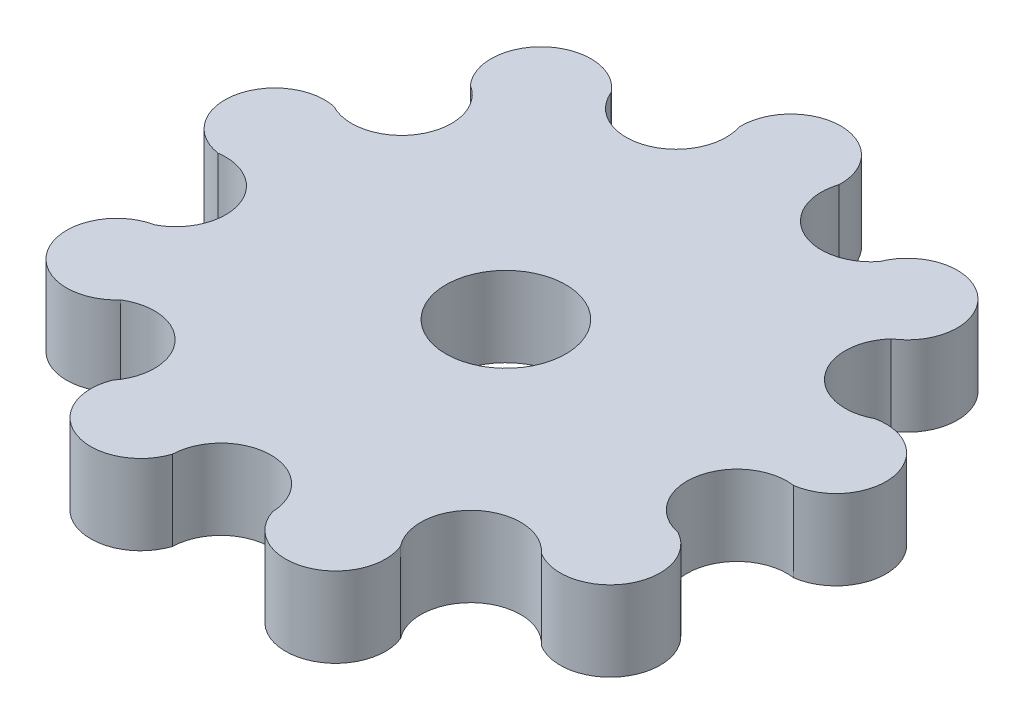
ISO-10303-21;
HEADER;
FILE_DESCRIPTION(('STEP AP214'),'2;1');
FILE_NAME('part.step','',(''),(''),'','','');
FILE_SCHEMA(('AUTOMOTIVE_DESIGN { 1 0 10303 214 1 1 1 1 }'));
ENDSEC;
DATA;
#1=APPLICATION_CONTEXT('core data for automotive mechanical design processes');
#2=APPLICATION_PROTOCOL_DEFINITION('international standard','automotive_design',2000,#1);
#3=PRODUCT_CONTEXT('',#1,'mechanical');
#4=PRODUCT('Part','Part','',(#3));
#5=PRODUCT_RELATED_PRODUCT_CATEGORY('part','',(#4));
#6=PRODUCT_DEFINITION_FORMATION('','',#4);
#7=PRODUCT_DEFINITION_CONTEXT('part definition',#1,'design');
#8=PRODUCT_DEFINITION('design','',#6,#7);
#9=PRODUCT_DEFINITION_SHAPE('','',#8);
#10=(LENGTH_UNIT() NAMED_UNIT(*) SI_UNIT(.MILLI.,.METRE.));
#11=(NAMED_UNIT(*) PLANE_ANGLE_UNIT() SI_UNIT($,.RADIAN.));
#12=(NAMED_UNIT(*) SI_UNIT($,.STERADIAN.) SOLID_ANGLE_UNIT());
#13=UNCERTAINTY_MEASURE_WITH_UNIT(LENGTH_MEASURE(1.E-05),#10,'distance_accuracy_value','');
#14=(GEOMETRIC_REPRESENTATION_CONTEXT(3) GLOBAL_UNCERTAINTY_ASSIGNED_CONTEXT((#13)) GLOBAL_UNIT_ASSIGNED_CONTEXT((#10,
#11,#12)) REPRESENTATION_CONTEXT('',''));
#15=CARTESIAN_POINT('',(0.,0.,0.));
#16=DIRECTION('',(0.,0.,1.));
#17=DIRECTION('',(1.,0.,0.));
#18=AXIS2_PLACEMENT_3D('',#15,#16,#17);
#19=CARTESIAN_POINT('',(18.319446876068,8.,-21.8322666288953));
#20=DIRECTION('',(0.,-1.,0.));
#21=DIRECTION('',(0.,0.,-1.));
#22=AXIS2_PLACEMENT_3D('',#19,#20,#21);
#23=CYLINDRICAL_SURFACE('',#22,5.);
#24=CARTESIAN_POINT('',(18.319446876068,0.,-21.8322666288953));
#25=DIRECTION('',(0.,1.,0.));
#26=DIRECTION('',(0.,0.,1.));
#27=AXIS2_PLACEMENT_3D('',#24,#25,#26);
#28=CIRCLE('',#27,5.);
#29=CARTESIAN_POINT('',(20.9547737409731,0.,-17.5831429174567));
#30=VERTEX_POINT('',#29);
#31=CARTESIAN_POINT('',(13.6772571938869,0.,-23.6897043680004));
#32=VERTEX_POINT('',#31);
#33=EDGE_CURVE('E392',#30,#32,#28,.T.);
#34=ORIENTED_EDGE('',*,*,#33,.T.);
#35=DIRECTION('',(0.,-1.,0.));
#36=VECTOR('',#35,1.);
#37=CARTESIAN_POINT('',(13.6772571938869,4.,-23.6897043680004));
#38=LINE('',#37,#36);
#39=CARTESIAN_POINT('',(13.6772571938869,8.,-23.6897043680004));
#40=VERTEX_POINT('',#39);
#41=EDGE_CURVE('E293',#40,#32,#38,.T.);
#42=ORIENTED_EDGE('',*,*,#41,.F.);
#43=CARTESIAN_POINT('',(18.319446876068,8.,-21.8322666288953));
#44=DIRECTION('',(0.,1.,0.));
#45=DIRECTION('',(0.,0.,1.));
#46=AXIS2_PLACEMENT_3D('',#43,#44,#45);
#47=CIRCLE('',#46,5.);
#48=CARTESIAN_POINT('',(20.9547737409731,8.,-17.5831429174567));
#49=VERTEX_POINT('',#48);
#50=EDGE_CURVE('E174',#49,#40,#47,.T.);
#51=ORIENTED_EDGE('',*,*,#50,.F.);
#52=DIRECTION('',(0.,-1.,0.));
#53=VECTOR('',#52,1.);
#54=CARTESIAN_POINT('',(20.9547737409731,4.,-17.5831429174567));
#55=LINE('',#54,#53);
#56=EDGE_CURVE('E161',#30,#49,#55,.F.);
#57=ORIENTED_EDGE('',*,*,#56,.F.);
#58=EDGE_LOOP('',(#34,#42,#51,#57));
#59=FACE_BOUND('',#58,.T.);
#60=ADVANCED_FACE('F157',(#59),#23,.T.);
#61=CARTESIAN_POINT('',(-24.6817240078463,8.,14.2500000000059));
#62=DIRECTION('',(0.,-1.,0.));
#63=DIRECTION('',(0.,0.,-1.));
#64=AXIS2_PLACEMENT_3D('',#61,#62,#63);
#65=CYLINDRICAL_SURFACE('',#64,5.);
#66=CARTESIAN_POINT('',(-24.6817240078463,0.,14.2500000000059));
#67=DIRECTION('',(0.,1.,0.));
#68=DIRECTION('',(0.,0.,1.));
#69=AXIS2_PLACEMENT_3D('',#66,#67,#68);
#70=CIRCLE('',#69,5.);
#71=CARTESIAN_POINT('',(-25.7048353153619,0.,9.35579493151586));
#72=VERTEX_POINT('',#71);
#73=CARTESIAN_POINT('',(-20.9547737409595,0.,17.5831429174567));
#74=VERTEX_POINT('',#73);
#75=EDGE_CURVE('E364',#72,#74,#70,.T.);
#76=ORIENTED_EDGE('',*,*,#75,.T.);
#77=DIRECTION('',(0.,-1.,0.));
#78=VECTOR('',#77,1.);
#79=CARTESIAN_POINT('',(-20.9547737409595,4.,17.5831429174567));
#80=LINE('',#79,#78);
#81=CARTESIAN_POINT('',(-20.9547737409595,8.,17.5831429174567));
#82=VERTEX_POINT('',#81);
#83=EDGE_CURVE('E166',#82,#74,#80,.T.);
#84=ORIENTED_EDGE('',*,*,#83,.F.);
#85=CARTESIAN_POINT('',(-24.6817240078463,8.,14.2500000000059));
#86=DIRECTION('',(0.,1.,0.));
#87=DIRECTION('',(0.,0.,1.));
#88=AXIS2_PLACEMENT_3D('',#85,#86,#87);
#89=CIRCLE('',#88,5.);
#90=CARTESIAN_POINT('',(-25.7048353153619,8.,9.35579493151586));
#91=VERTEX_POINT('',#90);
#92=EDGE_CURVE('E322',#91,#82,#89,.T.);
#93=ORIENTED_EDGE('',*,*,#92,.F.);
#94=DIRECTION('',(0.,-1.,0.));
#95=VECTOR('',#94,1.);
#96=CARTESIAN_POINT('',(-25.7048353153619,4.,9.35579493151586));
#97=LINE('',#96,#95);
#98=EDGE_CURVE('E12',#72,#91,#97,.F.);
#99=ORIENTED_EDGE('',*,*,#98,.F.);
#100=EDGE_LOOP('',(#76,#84,#93,#99));
#101=FACE_BOUND('',#100,.T.);
#102=ADVANCED_FACE('F469',(#101),#65,.T.);
#103=CARTESIAN_POINT('',(0.,8.,-28.5));
#104=DIRECTION('',(0.,-1.,0.));
#105=DIRECTION('',(0.,0.,-1.));
#106=AXIS2_PLACEMENT_3D('',#103,#104,#105);
#107=CYLINDRICAL_SURFACE('',#106,5.);
#108=CARTESIAN_POINT('',(0.,0.,-28.5));
#109=DIRECTION('',(0.,1.,0.));
#110=DIRECTION('',(0.,0.,1.));
#111=AXIS2_PLACEMENT_3D('',#108,#109,#110);
#112=CIRCLE('',#111,5.);
#113=CARTESIAN_POINT('',(4.99751251038124,0.,-28.3423018434382));
#114=VERTEX_POINT('',#113);
#115=CARTESIAN_POINT('',(-4.99751251038116,0.,-28.3423018434357));
#116=VERTEX_POINT('',#115);
#117=EDGE_CURVE('E307',#114,#116,#112,.T.);
#118=ORIENTED_EDGE('',*,*,#117,.T.);
#119=DIRECTION('',(0.,-1.,0.));
#120=VECTOR('',#119,1.);
#121=CARTESIAN_POINT('',(-4.99751251038116,8.,-28.3423018434357));
#122=LINE('',#121,#120);
#123=CARTESIAN_POINT('',(-4.99751251038116,8.,-28.3423018434357));
#124=VERTEX_POINT('',#123);
#125=EDGE_CURVE('E352',#124,#116,#122,.T.);
#126=ORIENTED_EDGE('',*,*,#125,.F.);
#127=CARTESIAN_POINT('',(0.,8.,-28.5));
#128=DIRECTION('',(0.,1.,0.));
#129=DIRECTION('',(0.,0.,1.));
#130=AXIS2_PLACEMENT_3D('',#127,#128,#129);
#131=CIRCLE('',#130,5.);
#132=CARTESIAN_POINT('',(4.99751251038124,8.,-28.3423018434382));
#133=VERTEX_POINT('',#132);
#134=EDGE_CURVE('E305',#133,#124,#131,.T.);
#135=ORIENTED_EDGE('',*,*,#134,.F.);
#136=DIRECTION('',(0.,-1.,0.));
#137=VECTOR('',#136,1.);
#138=CARTESIAN_POINT('',(4.99751251038124,8.,-28.3423018434382));
#139=LINE('',#138,#137);
#140=EDGE_CURVE('E397',#133,#114,#139,.T.);
#141=ORIENTED_EDGE('',*,*,#140,.T.);
#142=EDGE_LOOP('',(#118,#126,#135,#141));
#143=FACE_BOUND('',#142,.T.);
#144=ADVANCED_FACE('F486',(#143),#107,.T.);
#145=CARTESIAN_POINT('',(-9.74757408478117,8.,-26.7812396923961));
#146=DIRECTION('',(0.,-1.,0.));
#147=DIRECTION('',(0.,0.,-1.));
#148=AXIS2_PLACEMENT_3D('',#145,#146,#147);
#149=CYLINDRICAL_SURFACE('',#148,5.);
#150=CARTESIAN_POINT('',(-9.74757408478117,0.,-26.7812396923961));
#151=DIRECTION('',(0.,1.,0.));
#152=DIRECTION('',(0.,0.,1.));
#153=AXIS2_PLACEMENT_3D('',#150,#151,#152);
#154=CIRCLE('',#153,5.);
#155=CARTESIAN_POINT('',(-14.3897637669613,0.,-24.9238019532888));
#156=VERTEX_POINT('',#155);
#157=EDGE_CURVE('E289',#156,#116,#154,.T.);
#158=ORIENTED_EDGE('',*,*,#157,.F.);
#159=DIRECTION('',(0.,-1.,0.));
#160=VECTOR('',#159,1.);
#161=CARTESIAN_POINT('',(-14.3897637669613,8.,-24.9238019532888));
#162=LINE('',#161,#160);
#163=CARTESIAN_POINT('',(-14.3897637669613,8.,-24.9238019532888));
#164=VERTEX_POINT('',#163);
#165=EDGE_CURVE('E284',#164,#156,#162,.T.);
#166=ORIENTED_EDGE('',*,*,#165,.F.);
#167=CARTESIAN_POINT('',(-9.74757408478117,8.,-26.7812396923961));
#168=DIRECTION('',(0.,1.,0.));
#169=DIRECTION('',(0.,0.,1.));
#170=AXIS2_PLACEMENT_3D('',#167,#168,#169);
#171=CIRCLE('',#170,5.);
#172=EDGE_CURVE('E287',#164,#124,#171,.T.);
#173=ORIENTED_EDGE('',*,*,#172,.T.);
#174=ORIENTED_EDGE('',*,*,#125,.T.);
#175=EDGE_LOOP('',(#158,#166,#173,#174));
#176=FACE_BOUND('',#175,.T.);
#177=ADVANCED_FACE('F159',(#176),#149,.F.);
#178=CARTESIAN_POINT('',(-18.3194468760648,8.,-21.8322666288865));
#179=DIRECTION('',(0.,-1.,0.));
#180=DIRECTION('',(0.,0.,-1.));
#181=AXIS2_PLACEMENT_3D('',#178,#179,#180);
#182=CYLINDRICAL_SURFACE('',#181,5.);
#183=CARTESIAN_POINT('',(-18.3194468760648,0.,-21.8322666288865));
#184=DIRECTION('',(0.,1.,0.));
#185=DIRECTION('',(0.,0.,1.));
#186=AXIS2_PLACEMENT_3D('',#183,#184,#185);
#187=CIRCLE('',#186,5.);
#188=CARTESIAN_POINT('',(-22.04639714295,0.,-18.4991237114339));
#189=VERTEX_POINT('',#188);
#190=EDGE_CURVE('E354',#156,#189,#187,.T.);
#191=ORIENTED_EDGE('',*,*,#190,.T.);
#192=DIRECTION('',(0.,-1.,0.));
#193=VECTOR('',#192,1.);
#194=CARTESIAN_POINT('',(-22.04639714295,8.,-18.4991237114339));
#195=LINE('',#194,#193);
#196=CARTESIAN_POINT('',(-22.04639714295,8.,-18.4991237114339));
#197=VERTEX_POINT('',#196);
#198=EDGE_CURVE('E294',#197,#189,#195,.T.);
#199=ORIENTED_EDGE('',*,*,#198,.F.);
#200=CARTESIAN_POINT('',(-18.3194468760648,8.,-21.8322666288865));
#201=DIRECTION('',(0.,1.,0.));
#202=DIRECTION('',(0.,0.,1.));
#203=AXIS2_PLACEMENT_3D('',#200,#201,#202);
#204=CIRCLE('',#203,5.);
#205=EDGE_CURVE('E297',#164,#197,#204,.T.);
#206=ORIENTED_EDGE('',*,*,#205,.F.);
#207=ORIENTED_EDGE('',*,*,#165,.T.);
#208=EDGE_LOOP('',(#191,#199,#206,#207));
#209=FACE_BOUND('',#208,.T.);
#210=ADVANCED_FACE('F298',(#209),#182,.T.);
#211=CARTESIAN_POINT('',(-24.6817240078531,8.,-14.2499999999941));
#212=DIRECTION('',(0.,-1.,0.));
#213=DIRECTION('',(0.,0.,-1.));
#214=AXIS2_PLACEMENT_3D('',#211,#212,#213);
#215=CYLINDRICAL_SURFACE('',#214,5.);
#216=CARTESIAN_POINT('',(-24.6817240078531,0.,-14.2499999999941));
#217=DIRECTION('',(0.,1.,0.));
#218=DIRECTION('',(0.,0.,1.));
#219=AXIS2_PLACEMENT_3D('',#216,#217,#218);
#220=CIRCLE('',#219,5.);
#221=CARTESIAN_POINT('',(-27.043909653329,0.,-9.84317813199133));
#222=VERTEX_POINT('',#221);
#223=EDGE_CURVE('E356',#222,#189,#220,.T.);
#224=ORIENTED_EDGE('',*,*,#223,.F.);
#225=DIRECTION('',(0.,-1.,0.));
#226=VECTOR('',#225,1.);
#227=CARTESIAN_POINT('',(-27.043909653329,8.,-9.84317813199133));
#228=LINE('',#227,#226);
#229=CARTESIAN_POINT('',(-27.043909653329,8.,-9.84317813199133));
#230=VERTEX_POINT('',#229);
#231=EDGE_CURVE('E419',#230,#222,#228,.T.);
#232=ORIENTED_EDGE('',*,*,#231,.F.);
#233=CARTESIAN_POINT('',(-24.6817240078531,8.,-14.2499999999941));
#234=DIRECTION('',(0.,1.,0.));
#235=DIRECTION('',(0.,0.,1.));
#236=AXIS2_PLACEMENT_3D('',#233,#234,#235);
#237=CIRCLE('',#236,5.);
#238=EDGE_CURVE('E301',#230,#197,#237,.T.);
#239=ORIENTED_EDGE('',*,*,#238,.T.);
#240=ORIENTED_EDGE('',*,*,#198,.T.);
#241=EDGE_LOOP('',(#224,#232,#239,#240));
#242=FACE_BOUND('',#241,.T.);
#243=ADVANCED_FACE('F482',(#242),#215,.F.);
#244=CARTESIAN_POINT('',(-28.0670209608423,8.,-4.94897306350079));
#245=DIRECTION('',(0.,-1.,0.));
#246=DIRECTION('',(0.,0.,-1.));
#247=AXIS2_PLACEMENT_3D('',#244,#245,#246);
#248=CYLINDRICAL_SURFACE('',#247,5.);
#249=CARTESIAN_POINT('',(-28.0670209608423,0.,-4.94897306350079));
#250=DIRECTION('',(0.,1.,0.));
#251=DIRECTION('',(0.,0.,1.));
#252=AXIS2_PLACEMENT_3D('',#249,#250,#251);
#253=CIRCLE('',#252,5.);
#254=CARTESIAN_POINT('',(-28.7795275339175,0.,6.88685219962792E-12));
#255=VERTEX_POINT('',#254);
#256=EDGE_CURVE('E359',#222,#255,#253,.T.);
#257=ORIENTED_EDGE('',*,*,#256,.T.);
#258=DIRECTION('',(0.,-1.,0.));
#259=VECTOR('',#258,1.);
#260=CARTESIAN_POINT('',(-28.7795275339175,8.,6.88685219962792E-12));
#261=LINE('',#260,#259);
#262=CARTESIAN_POINT('',(-28.7795275339175,8.,6.88685219962792E-12));
#263=VERTEX_POINT('',#262);
#264=EDGE_CURVE('E416',#263,#255,#261,.T.);
#265=ORIENTED_EDGE('',*,*,#264,.F.);
#266=CARTESIAN_POINT('',(-28.0670209608423,8.,-4.94897306350079));
#267=DIRECTION('',(0.,1.,0.));
#268=DIRECTION('',(0.,0.,1.));
#269=AXIS2_PLACEMENT_3D('',#266,#267,#268);
#270=CIRCLE('',#269,5.);
#271=EDGE_CURVE('E317',#230,#263,#270,.T.);
#272=ORIENTED_EDGE('',*,*,#271,.F.);
#273=ORIENTED_EDGE('',*,*,#231,.T.);
#274=EDGE_LOOP('',(#257,#265,#272,#273));
#275=FACE_BOUND('',#274,.T.);
#276=ADVANCED_FACE('F480',(#275),#248,.T.);
#277=CARTESIAN_POINT('',(-28.0670209608399,8.,4.94897306351423));
#278=DIRECTION('',(0.,-1.,0.));
#279=DIRECTION('',(0.,0.,-1.));
#280=AXIS2_PLACEMENT_3D('',#277,#278,#279);
#281=CYLINDRICAL_SURFACE('',#280,5.);
#282=CARTESIAN_POINT('',(-28.0670209608399,0.,4.94897306351423));
#283=DIRECTION('',(0.,1.,0.));
#284=DIRECTION('',(0.,0.,1.));
#285=AXIS2_PLACEMENT_3D('',#282,#283,#284);
#286=CIRCLE('',#285,5.);
#287=EDGE_CURVE('E362',#72,#255,#286,.T.);
#288=ORIENTED_EDGE('',*,*,#287,.F.);
#289=ORIENTED_EDGE('',*,*,#98,.T.);
#290=CARTESIAN_POINT('',(-28.0670209608399,8.,4.94897306351423));
#291=DIRECTION('',(0.,1.,0.));
#292=DIRECTION('',(0.,0.,1.));
#293=AXIS2_PLACEMENT_3D('',#290,#291,#292);
#294=CIRCLE('',#293,5.);
#295=EDGE_CURVE('E320',#91,#263,#294,.T.);
#296=ORIENTED_EDGE('',*,*,#295,.T.);
#297=ORIENTED_EDGE('',*,*,#264,.T.);
#298=EDGE_LOOP('',(#288,#289,#296,#297));
#299=FACE_BOUND('',#298,.T.);
#300=ADVANCED_FACE('F476',(#299),#281,.F.);
#301=CARTESIAN_POINT('',(-18.3194468760543,8.,21.8322666288953));
#302=DIRECTION('',(0.,-1.,0.));
#303=DIRECTION('',(0.,0.,-1.));
#304=AXIS2_PLACEMENT_3D('',#301,#302,#303);
#305=CYLINDRICAL_SURFACE('',#304,5.);
#306=CARTESIAN_POINT('',(-18.3194468760543,8.,21.8322666288953));
#307=DIRECTION('',(0.,1.,0.));
#308=DIRECTION('',(0.,0.,1.));
#309=AXIS2_PLACEMENT_3D('',#306,#307,#308);
#310=CIRCLE('',#309,5.);
#311=CARTESIAN_POINT('',(-14.3897637669494,8.,24.9238019532956));
#312=VERTEX_POINT('',#311);
#313=EDGE_CURVE('E324',#312,#82,#310,.T.);
#314=ORIENTED_EDGE('',*,*,#313,.T.);
#315=ORIENTED_EDGE('',*,*,#83,.T.);
#316=CARTESIAN_POINT('',(-18.3194468760543,0.,21.8322666288953));
#317=DIRECTION('',(0.,1.,0.));
#318=DIRECTION('',(0.,0.,1.));
#319=AXIS2_PLACEMENT_3D('',#316,#317,#318);
#320=CIRCLE('',#319,5.);
#321=CARTESIAN_POINT('',(-14.3897637669494,0.,24.9238019532956));
#322=VERTEX_POINT('',#321);
#323=EDGE_CURVE('E366',#322,#74,#320,.T.);
#324=ORIENTED_EDGE('',*,*,#323,.F.);
#325=DIRECTION('',(0.,-1.,0.));
#326=VECTOR('',#325,1.);
#327=CARTESIAN_POINT('',(-14.3897637669494,8.,24.9238019532956));
#328=LINE('',#327,#326);
#329=EDGE_CURVE('E414',#312,#322,#328,.T.);
#330=ORIENTED_EDGE('',*,*,#329,.F.);
#331=EDGE_LOOP('',(#314,#315,#324,#330));
#332=FACE_BOUND('',#331,.T.);
#333=ADVANCED_FACE('F465',(#332),#305,.F.);
#334=CARTESIAN_POINT('',(-9.74757408476834,8.,26.7812396924007));
#335=DIRECTION('',(0.,-1.,0.));
#336=DIRECTION('',(0.,0.,-1.));
#337=AXIS2_PLACEMENT_3D('',#334,#335,#336);
#338=CYLINDRICAL_SURFACE('',#337,5.);
#339=CARTESIAN_POINT('',(-9.74757408476834,0.,26.7812396924007));
#340=DIRECTION('',(0.,1.,0.));
#341=DIRECTION('',(0.,0.,1.));
#342=AXIS2_PLACEMENT_3D('',#339,#340,#341);
#343=CIRCLE('',#342,5.);
#344=CARTESIAN_POINT('',(-4.99751251036761,0.,28.3423018434382));
#345=VERTEX_POINT('',#344);
#346=EDGE_CURVE('E369',#322,#345,#343,.T.);
#347=ORIENTED_EDGE('',*,*,#346,.T.);
#348=DIRECTION('',(0.,-1.,0.));
#349=VECTOR('',#348,1.);
#350=CARTESIAN_POINT('',(-4.99751251036761,8.,28.3423018434382));
#351=LINE('',#350,#349);
#352=CARTESIAN_POINT('',(-4.99751251036761,8.,28.3423018434382));
#353=VERTEX_POINT('',#352);
#354=EDGE_CURVE('E412',#353,#345,#351,.T.);
#355=ORIENTED_EDGE('',*,*,#354,.F.);
#356=CARTESIAN_POINT('',(-9.74757408476834,8.,26.7812396924007));
#357=DIRECTION('',(0.,1.,0.));
#358=DIRECTION('',(0.,0.,1.));
#359=AXIS2_PLACEMENT_3D('',#356,#357,#358);
#360=CIRCLE('',#359,5.);
#361=EDGE_CURVE('E327',#312,#353,#360,.T.);
#362=ORIENTED_EDGE('',*,*,#361,.F.);
#363=ORIENTED_EDGE('',*,*,#329,.T.);
#364=EDGE_LOOP('',(#347,#355,#362,#363));
#365=FACE_BOUND('',#364,.T.);
#366=ADVANCED_FACE('F462',(#365),#338,.T.);
#367=CARTESIAN_POINT('',(1.36312150083817E-11,8.,28.5));
#368=DIRECTION('',(0.,-1.,0.));
#369=DIRECTION('',(0.,0.,-1.));
#370=AXIS2_PLACEMENT_3D('',#367,#368,#369);
#371=CYLINDRICAL_SURFACE('',#370,5.);
#372=CARTESIAN_POINT('',(1.36312150083817E-11,0.,28.5));
#373=DIRECTION('',(0.,1.,0.));
#374=DIRECTION('',(0.,0.,1.));
#375=AXIS2_PLACEMENT_3D('',#372,#373,#374);
#376=CIRCLE('',#375,5.);
#377=CARTESIAN_POINT('',(4.9975125103948,0.,28.3423018434358));
#378=VERTEX_POINT('',#377);
#379=EDGE_CURVE('E372',#378,#345,#376,.T.);
#380=ORIENTED_EDGE('',*,*,#379,.F.);
#381=DIRECTION('',(0.,-1.,0.));
#382=VECTOR('',#381,1.);
#383=CARTESIAN_POINT('',(4.9975125103948,8.,28.3423018434358));
#384=LINE('',#383,#382);
#385=CARTESIAN_POINT('',(4.9975125103948,8.,28.3423018434358));
#386=VERTEX_POINT('',#385);
#387=EDGE_CURVE('E410',#386,#378,#384,.T.);
#388=ORIENTED_EDGE('',*,*,#387,.F.);
#389=CARTESIAN_POINT('',(1.36312150083817E-11,8.,28.5));
#390=DIRECTION('',(0.,1.,0.));
#391=DIRECTION('',(0.,0.,1.));
#392=AXIS2_PLACEMENT_3D('',#389,#390,#391);
#393=CIRCLE('',#392,5.);
#394=EDGE_CURVE('E329',#386,#353,#393,.T.);
#395=ORIENTED_EDGE('',*,*,#394,.T.);
#396=ORIENTED_EDGE('',*,*,#354,.T.);
#397=EDGE_LOOP('',(#380,#388,#395,#396));
#398=FACE_BOUND('',#397,.T.);
#399=ADVANCED_FACE('F457',(#398),#371,.F.);
#400=CARTESIAN_POINT('',(9.74757408479478,8.,26.7812396923961));
#401=DIRECTION('',(0.,-1.,0.));
#402=DIRECTION('',(0.,0.,-1.));
#403=AXIS2_PLACEMENT_3D('',#400,#401,#402);
#404=CYLINDRICAL_SURFACE('',#403,5.);
#405=CARTESIAN_POINT('',(9.74757408479478,0.,26.7812396923961));
#406=DIRECTION('',(0.,1.,0.));
#407=DIRECTION('',(0.,0.,1.));
#408=AXIS2_PLACEMENT_3D('',#405,#406,#407);
#409=CIRCLE('',#408,5.);
#410=CARTESIAN_POINT('',(14.3897637669749,0.,24.9238019532887));
#411=VERTEX_POINT('',#410);
#412=EDGE_CURVE('E375',#378,#411,#409,.T.);
#413=ORIENTED_EDGE('',*,*,#412,.T.);
#414=DIRECTION('',(0.,-1.,0.));
#415=VECTOR('',#414,1.);
#416=CARTESIAN_POINT('',(14.3897637669749,8.,24.9238019532887));
#417=LINE('',#416,#415);
#418=CARTESIAN_POINT('',(14.3897637669749,8.,24.9238019532887));
#419=VERTEX_POINT('',#418);
#420=EDGE_CURVE('E408',#419,#411,#417,.T.);
#421=ORIENTED_EDGE('',*,*,#420,.F.);
#422=CARTESIAN_POINT('',(9.74757408479478,8.,26.7812396923961));
#423=DIRECTION('',(0.,1.,0.));
#424=DIRECTION('',(0.,0.,1.));
#425=AXIS2_PLACEMENT_3D('',#422,#423,#424);
#426=CIRCLE('',#425,5.);
#427=EDGE_CURVE('E332',#386,#419,#426,.T.);
#428=ORIENTED_EDGE('',*,*,#427,.F.);
#429=ORIENTED_EDGE('',*,*,#387,.T.);
#430=EDGE_LOOP('',(#413,#421,#428,#429));
#431=FACE_BOUND('',#430,.T.);
#432=ADVANCED_FACE('F453',(#431),#404,.T.);
#433=CARTESIAN_POINT('',(18.3194468760784,8.,21.8322666288865));
#434=DIRECTION('',(0.,-1.,0.));
#435=DIRECTION('',(0.,0.,-1.));
#436=AXIS2_PLACEMENT_3D('',#433,#434,#435);
#437=CYLINDRICAL_SURFACE('',#436,5.);
#438=CARTESIAN_POINT('',(18.3194468760784,0.,21.8322666288865));
#439=DIRECTION('',(0.,1.,0.));
#440=DIRECTION('',(0.,0.,1.));
#441=AXIS2_PLACEMENT_3D('',#438,#439,#440);
#442=CIRCLE('',#441,5.);
#443=CARTESIAN_POINT('',(22.0463971429636,0.,18.4991237114339));
#444=VERTEX_POINT('',#443);
#445=EDGE_CURVE('E378',#444,#411,#442,.T.);
#446=ORIENTED_EDGE('',*,*,#445,.F.);
#447=DIRECTION('',(0.,-1.,0.));
#448=VECTOR('',#447,1.);
#449=CARTESIAN_POINT('',(22.0463971429636,8.,18.4991237114339));
#450=LINE('',#449,#448);
#451=CARTESIAN_POINT('',(22.0463971429636,8.,18.4991237114339));
#452=VERTEX_POINT('',#451);
#453=EDGE_CURVE('E406',#452,#444,#450,.T.);
#454=ORIENTED_EDGE('',*,*,#453,.F.);
#455=CARTESIAN_POINT('',(18.3194468760784,8.,21.8322666288865));
#456=DIRECTION('',(0.,1.,0.));
#457=DIRECTION('',(0.,0.,1.));
#458=AXIS2_PLACEMENT_3D('',#455,#456,#457);
#459=CIRCLE('',#458,5.);
#460=EDGE_CURVE('E334',#452,#419,#459,.T.);
#461=ORIENTED_EDGE('',*,*,#460,.T.);
#462=ORIENTED_EDGE('',*,*,#420,.T.);
#463=EDGE_LOOP('',(#446,#454,#461,#462));
#464=FACE_BOUND('',#463,.T.);
#465=ADVANCED_FACE('F448',(#464),#437,.F.);
#466=CARTESIAN_POINT('',(24.6817240078667,8.,14.2499999999941));
#467=DIRECTION('',(0.,-1.,0.));
#468=DIRECTION('',(0.,0.,-1.));
#469=AXIS2_PLACEMENT_3D('',#466,#467,#468);
#470=CYLINDRICAL_SURFACE('',#469,5.);
#471=CARTESIAN_POINT('',(24.6817240078667,0.,14.2499999999941));
#472=DIRECTION('',(0.,1.,0.));
#473=DIRECTION('',(0.,0.,1.));
#474=AXIS2_PLACEMENT_3D('',#471,#472,#473);
#475=CIRCLE('',#474,5.);
#476=CARTESIAN_POINT('',(27.0439096533427,0.,9.84317813199136));
#477=VERTEX_POINT('',#476);
#478=EDGE_CURVE('E381',#444,#477,#475,.T.);
#479=ORIENTED_EDGE('',*,*,#478,.T.);
#480=DIRECTION('',(0.,-1.,0.));
#481=VECTOR('',#480,1.);
#482=CARTESIAN_POINT('',(27.0439096533427,8.,9.84317813199136));
#483=LINE('',#482,#481);
#484=CARTESIAN_POINT('',(27.0439096533427,8.,9.84317813199136));
#485=VERTEX_POINT('',#484);
#486=EDGE_CURVE('E404',#485,#477,#483,.T.);
#487=ORIENTED_EDGE('',*,*,#486,.F.);
#488=CARTESIAN_POINT('',(24.6817240078667,8.,14.2499999999941));
#489=DIRECTION('',(0.,1.,0.));
#490=DIRECTION('',(0.,0.,1.));
#491=AXIS2_PLACEMENT_3D('',#488,#489,#490);
#492=CIRCLE('',#491,5.);
#493=EDGE_CURVE('E337',#452,#485,#492,.T.);
#494=ORIENTED_EDGE('',*,*,#493,.F.);
#495=ORIENTED_EDGE('',*,*,#453,.T.);
#496=EDGE_LOOP('',(#479,#487,#494,#495));
#497=FACE_BOUND('',#496,.T.);
#498=ADVANCED_FACE('F444',(#497),#470,.T.);
#499=CARTESIAN_POINT('',(28.0670209608559,8.,4.9489730635008));
#500=DIRECTION('',(0.,-1.,0.));
#501=DIRECTION('',(0.,0.,-1.));
#502=AXIS2_PLACEMENT_3D('',#499,#500,#501);
#503=CYLINDRICAL_SURFACE('',#502,5.);
#504=CARTESIAN_POINT('',(28.0670209608559,0.,4.9489730635008));
#505=DIRECTION('',(0.,1.,0.));
#506=DIRECTION('',(0.,0.,1.));
#507=AXIS2_PLACEMENT_3D('',#504,#505,#506);
#508=CIRCLE('',#507,5.);
#509=CARTESIAN_POINT('',(28.7795275339311,0.,-6.88251539093798E-12));
#510=VERTEX_POINT('',#509);
#511=EDGE_CURVE('E384',#510,#477,#508,.T.);
#512=ORIENTED_EDGE('',*,*,#511,.F.);
#513=DIRECTION('',(0.,-1.,0.));
#514=VECTOR('',#513,1.);
#515=CARTESIAN_POINT('',(28.7795275339311,8.,-6.88251539093798E-12));
#516=LINE('',#515,#514);
#517=CARTESIAN_POINT('',(28.7795275339311,8.,-6.88251539093798E-12));
#518=VERTEX_POINT('',#517);
#519=EDGE_CURVE('E402',#518,#510,#516,.T.);
#520=ORIENTED_EDGE('',*,*,#519,.F.);
#521=CARTESIAN_POINT('',(28.0670209608559,8.,4.9489730635008));
#522=DIRECTION('',(0.,1.,0.));
#523=DIRECTION('',(0.,0.,1.));
#524=AXIS2_PLACEMENT_3D('',#521,#522,#523);
#525=CIRCLE('',#524,5.);
#526=EDGE_CURVE('E339',#518,#485,#525,.T.);
#527=ORIENTED_EDGE('',*,*,#526,.T.);
#528=ORIENTED_EDGE('',*,*,#486,.T.);
#529=EDGE_LOOP('',(#512,#520,#527,#528));
#530=FACE_BOUND('',#529,.T.);
#531=ADVANCED_FACE('F440',(#530),#503,.F.);
#532=CARTESIAN_POINT('',(28.0670209608536,8.,-4.94897306351423));
#533=DIRECTION('',(0.,-1.,0.));
#534=DIRECTION('',(0.,0.,-1.));
#535=AXIS2_PLACEMENT_3D('',#532,#533,#534);
#536=CYLINDRICAL_SURFACE('',#535,5.);
#537=CARTESIAN_POINT('',(28.0670209608536,0.,-4.94897306351423));
#538=DIRECTION('',(0.,1.,0.));
#539=DIRECTION('',(0.,0.,1.));
#540=AXIS2_PLACEMENT_3D('',#537,#538,#539);
#541=CIRCLE('',#540,5.);
#542=CARTESIAN_POINT('',(27.043909653338,0.,-9.84317813200428));
#543=VERTEX_POINT('',#542);
#544=EDGE_CURVE('E387',#510,#543,#541,.T.);
#545=ORIENTED_EDGE('',*,*,#544,.T.);
#546=DIRECTION('',(0.,-1.,0.));
#547=VECTOR('',#546,1.);
#548=CARTESIAN_POINT('',(27.043909653338,8.,-9.84317813200428));
#549=LINE('',#548,#547);
#550=CARTESIAN_POINT('',(27.043909653338,8.,-9.84317813200428));
#551=VERTEX_POINT('',#550);
#552=EDGE_CURVE('E399',#551,#543,#549,.T.);
#553=ORIENTED_EDGE('',*,*,#552,.F.);
#554=CARTESIAN_POINT('',(28.0670209608536,8.,-4.94897306351423));
#555=DIRECTION('',(0.,1.,0.));
#556=DIRECTION('',(0.,0.,1.));
#557=AXIS2_PLACEMENT_3D('',#554,#555,#556);
#558=CIRCLE('',#557,5.);
#559=EDGE_CURVE('E342',#518,#551,#558,.T.);
#560=ORIENTED_EDGE('',*,*,#559,.F.);
#561=ORIENTED_EDGE('',*,*,#519,.T.);
#562=EDGE_LOOP('',(#545,#553,#560,#561));
#563=FACE_BOUND('',#562,.T.);
#564=ADVANCED_FACE('F433',(#563),#536,.T.);
#565=CARTESIAN_POINT('',(24.6817240078599,8.,-14.2500000000059));
#566=DIRECTION('',(0.,-1.,0.));
#567=DIRECTION('',(0.,0.,-1.));
#568=AXIS2_PLACEMENT_3D('',#565,#566,#567);
#569=CYLINDRICAL_SURFACE('',#568,5.);
#570=CARTESIAN_POINT('',(24.6817240078599,0.,-14.2500000000059));
#571=DIRECTION('',(0.,1.,0.));
#572=DIRECTION('',(0.,0.,1.));
#573=AXIS2_PLACEMENT_3D('',#570,#571,#572);
#574=CIRCLE('',#573,5.);
#575=EDGE_CURVE('E390',#30,#543,#574,.T.);
#576=ORIENTED_EDGE('',*,*,#575,.F.);
#577=ORIENTED_EDGE('',*,*,#56,.T.);
#578=CARTESIAN_POINT('',(24.6817240078599,8.,-14.2500000000059));
#579=DIRECTION('',(0.,1.,0.));
#580=DIRECTION('',(0.,0.,1.));
#581=AXIS2_PLACEMENT_3D('',#578,#579,#580);
#582=CIRCLE('',#581,5.);
#583=EDGE_CURVE('E345',#49,#551,#582,.T.);
#584=ORIENTED_EDGE('',*,*,#583,.T.);
#585=ORIENTED_EDGE('',*,*,#552,.T.);
#586=EDGE_LOOP('',(#576,#577,#584,#585));
#587=FACE_BOUND('',#586,.T.);
#588=ADVANCED_FACE('F428',(#587),#569,.F.);
#589=CARTESIAN_POINT('',(9.74757408478196,8.,-26.7812396924007));
#590=DIRECTION('',(0.,-1.,0.));
#591=DIRECTION('',(0.,0.,-1.));
#592=AXIS2_PLACEMENT_3D('',#589,#590,#591);
#593=CYLINDRICAL_SURFACE('',#592,5.);
#594=CARTESIAN_POINT('',(9.74757408478196,8.,-26.7812396924007));
#595=DIRECTION('',(0.,1.,0.));
#596=DIRECTION('',(0.,0.,1.));
#597=AXIS2_PLACEMENT_3D('',#594,#595,#596);
#598=CIRCLE('',#597,5.);
#599=EDGE_CURVE('E348',#133,#40,#598,.T.);
#600=ORIENTED_EDGE('',*,*,#599,.T.);
#601=ORIENTED_EDGE('',*,*,#41,.T.);
#602=CARTESIAN_POINT('',(9.74757408478196,0.,-26.7812396924007));
#603=DIRECTION('',(0.,1.,0.));
#604=DIRECTION('',(0.,0.,1.));
#605=AXIS2_PLACEMENT_3D('',#602,#603,#604);
#606=CIRCLE('',#605,5.);
#607=EDGE_CURVE('E310',#114,#32,#606,.T.);
#608=ORIENTED_EDGE('',*,*,#607,.F.);
#609=ORIENTED_EDGE('',*,*,#140,.F.);
#610=EDGE_LOOP('',(#600,#601,#608,#609));
#611=FACE_BOUND('',#610,.T.);
#612=ADVANCED_FACE('F485',(#611),#593,.F.);
#613=CARTESIAN_POINT('',(0.,0.,0.));
#614=DIRECTION('',(0.,1.,0.));
#615=DIRECTION('',(0.,0.,1.));
#616=AXIS2_PLACEMENT_3D('',#613,#614,#615);
#617=PLANE('',#616);
#618=CARTESIAN_POINT('',(0.,0.,0.));
#619=DIRECTION('',(0.,1.,0.));
#620=DIRECTION('',(0.,0.,1.));
#621=AXIS2_PLACEMENT_3D('',#618,#619,#620);
#622=CIRCLE('',#621,6.);
#623=CARTESIAN_POINT('',(0.,0.,6.));
#624=VERTEX_POINT('',#623);
#625=EDGE_CURVE('E313',#624,#624,#622,.T.);
#626=ORIENTED_EDGE('',*,*,#625,.T.);
#627=EDGE_LOOP('',(#626));
#628=FACE_BOUND('',#627,.T.);
#629=ORIENTED_EDGE('',*,*,#607,.T.);
#630=ORIENTED_EDGE('',*,*,#33,.F.);
#631=ORIENTED_EDGE('',*,*,#575,.T.);
#632=ORIENTED_EDGE('',*,*,#544,.F.);
#633=ORIENTED_EDGE('',*,*,#511,.T.);
#634=ORIENTED_EDGE('',*,*,#478,.F.);
#635=ORIENTED_EDGE('',*,*,#445,.T.);
#636=ORIENTED_EDGE('',*,*,#412,.F.);
#637=ORIENTED_EDGE('',*,*,#379,.T.);
#638=ORIENTED_EDGE('',*,*,#346,.F.);
#639=ORIENTED_EDGE('',*,*,#323,.T.);
#640=ORIENTED_EDGE('',*,*,#75,.F.);
#641=ORIENTED_EDGE('',*,*,#287,.T.);
#642=ORIENTED_EDGE('',*,*,#256,.F.);
#643=ORIENTED_EDGE('',*,*,#223,.T.);
#644=ORIENTED_EDGE('',*,*,#190,.F.);
#645=ORIENTED_EDGE('',*,*,#157,.T.);
#646=ORIENTED_EDGE('',*,*,#117,.F.);
#647=EDGE_LOOP('',(#629,#630,#631,#632,#633,#634,#635,#636,#637,#638,#639,#640,#641,#642,#643,
#644,#645,#646));
#648=FACE_BOUND('',#647,.T.);
#649=ADVANCED_FACE('F437',(#628,#648),#617,.F.);
#650=CARTESIAN_POINT('',(0.,8.,0.));
#651=DIRECTION('',(0.,1.,0.));
#652=DIRECTION('',(0.,0.,1.));
#653=AXIS2_PLACEMENT_3D('',#650,#651,#652);
#654=PLANE('',#653);
#655=CARTESIAN_POINT('',(0.,8.,0.));
#656=DIRECTION('',(0.,1.,0.));
#657=DIRECTION('',(0.,0.,1.));
#658=AXIS2_PLACEMENT_3D('',#655,#656,#657);
#659=CIRCLE('',#658,6.);
#660=CARTESIAN_POINT('',(0.,8.,6.));
#661=VERTEX_POINT('',#660);
#662=EDGE_CURVE('E816',#661,#661,#659,.T.);
#663=ORIENTED_EDGE('',*,*,#662,.F.);
#664=EDGE_LOOP('',(#663));
#665=FACE_BOUND('',#664,.T.);
#666=ORIENTED_EDGE('',*,*,#583,.F.);
#667=ORIENTED_EDGE('',*,*,#50,.T.);
#668=ORIENTED_EDGE('',*,*,#599,.F.);
#669=ORIENTED_EDGE('',*,*,#134,.T.);
#670=ORIENTED_EDGE('',*,*,#172,.F.);
#671=ORIENTED_EDGE('',*,*,#205,.T.);
#672=ORIENTED_EDGE('',*,*,#238,.F.);
#673=ORIENTED_EDGE('',*,*,#271,.T.);
#674=ORIENTED_EDGE('',*,*,#295,.F.);
#675=ORIENTED_EDGE('',*,*,#92,.T.);
#676=ORIENTED_EDGE('',*,*,#313,.F.);
#677=ORIENTED_EDGE('',*,*,#361,.T.);
#678=ORIENTED_EDGE('',*,*,#394,.F.);
#679=ORIENTED_EDGE('',*,*,#427,.T.);
#680=ORIENTED_EDGE('',*,*,#460,.F.);
#681=ORIENTED_EDGE('',*,*,#493,.T.);
#682=ORIENTED_EDGE('',*,*,#526,.F.);
#683=ORIENTED_EDGE('',*,*,#559,.T.);
#684=EDGE_LOOP('',(#666,#667,#668,#669,#670,#671,#672,#673,#674,#675,#676,#677,#678,#679,#680,
#681,#682,#683));
#685=FACE_BOUND('',#684,.T.);
#686=ADVANCED_FACE('F303',(#665,#685),#654,.T.);
#687=CARTESIAN_POINT('',(0.,-2.,0.));
#688=DIRECTION('',(0.,1.,0.));
#689=DIRECTION('',(0.,0.,1.));
#690=AXIS2_PLACEMENT_3D('',#687,#688,#689);
#691=CYLINDRICAL_SURFACE('',#690,6.);
#692=ORIENTED_EDGE('',*,*,#662,.T.);
#693=EDGE_LOOP('',(#692));
#694=FACE_BOUND('',#693,.T.);
#695=ORIENTED_EDGE('',*,*,#625,.F.);
#696=EDGE_LOOP('',(#695));
#697=FACE_BOUND('',#696,.T.);
#698=ADVANCED_FACE('F501',(#694,#697),#691,.F.);
#699=CLOSED_SHELL('',(#60,#102,#144,#177,#210,#243,#276,#300,#333,#366,#399,#432,#465,#498,#531,
#564,#588,#612,#649,#686,#698));
#700=MANIFOLD_SOLID_BREP('B2',#699);
#701=ADVANCED_BREP_SHAPE_REPRESENTATION('',(#18,#700),#14);
#702=SHAPE_DEFINITION_REPRESENTATION(#9,#701);
ENDSEC;
END-ISO-10303-21;
